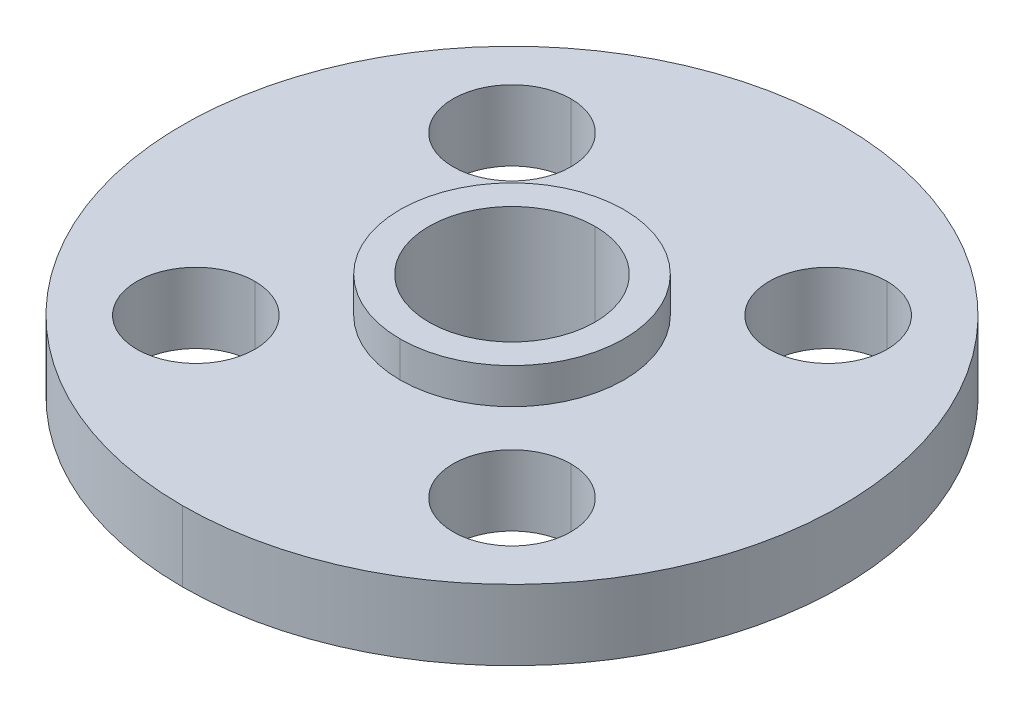
ISO-10303-21;
HEADER;
FILE_DESCRIPTION(('STEP AP214'),'2;1');
FILE_NAME('part.step','',(''),(''),'','','');
FILE_SCHEMA(('AUTOMOTIVE_DESIGN { 1 0 10303 214 1 1 1 1 }'));
ENDSEC;
DATA;
#1=APPLICATION_CONTEXT('core data for automotive mechanical design processes');
#2=APPLICATION_PROTOCOL_DEFINITION('international standard','automotive_design',2000,#1);
#3=PRODUCT_CONTEXT('',#1,'mechanical');
#4=PRODUCT('Part','Part','',(#3));
#5=PRODUCT_RELATED_PRODUCT_CATEGORY('part','',(#4));
#6=PRODUCT_DEFINITION_FORMATION('','',#4);
#7=PRODUCT_DEFINITION_CONTEXT('part definition',#1,'design');
#8=PRODUCT_DEFINITION('design','',#6,#7);
#9=PRODUCT_DEFINITION_SHAPE('','',#8);
#10=(LENGTH_UNIT() NAMED_UNIT(*) SI_UNIT(.MILLI.,.METRE.));
#11=(NAMED_UNIT(*) PLANE_ANGLE_UNIT() SI_UNIT($,.RADIAN.));
#12=(NAMED_UNIT(*) SI_UNIT($,.STERADIAN.) SOLID_ANGLE_UNIT());
#13=UNCERTAINTY_MEASURE_WITH_UNIT(LENGTH_MEASURE(1.E-05),#10,'distance_accuracy_value','');
#14=(GEOMETRIC_REPRESENTATION_CONTEXT(3) GLOBAL_UNCERTAINTY_ASSIGNED_CONTEXT((#13)) GLOBAL_UNIT_ASSIGNED_CONTEXT((#10,
#11,#12)) REPRESENTATION_CONTEXT('',''));
#15=CARTESIAN_POINT('',(0.,0.,0.));
#16=DIRECTION('',(0.,0.,1.));
#17=DIRECTION('',(1.,0.,0.));
#18=AXIS2_PLACEMENT_3D('',#15,#16,#17);
#19=CARTESIAN_POINT('',(-21.3192694527746,-7.95,-21.3192694527743));
#20=DIRECTION('',(0.,1.,0.));
#21=DIRECTION('',(0.,0.,1.));
#22=AXIS2_PLACEMENT_3D('',#19,#20,#21);
#23=CYLINDRICAL_SURFACE('',#22,7.95);
#24=DIRECTION('',(0.,1.,0.));
#25=VECTOR('',#24,1.);
#26=CARTESIAN_POINT('',(-21.3192694527746,-7.95,-29.2692694527743));
#27=LINE('',#26,#25);
#28=CARTESIAN_POINT('',(-21.3192694527746,-6.35,-29.2692694527743));
#29=VERTEX_POINT('',#28);
#30=CARTESIAN_POINT('',(-21.3192694527746,3.15,-29.2692694527743));
#31=VERTEX_POINT('',#30);
#32=EDGE_CURVE('E242',#29,#31,#27,.T.);
#33=ORIENTED_EDGE('',*,*,#32,.F.);
#34=CARTESIAN_POINT('',(-21.3192694527746,-6.35,-21.3192694527743));
#35=DIRECTION('',(0.,1.,0.));
#36=DIRECTION('',(0.,0.,1.));
#37=AXIS2_PLACEMENT_3D('',#34,#35,#36);
#38=CIRCLE('',#37,7.95);
#39=CARTESIAN_POINT('',(-21.3192694527746,-6.35,-13.3692694527743));
#40=VERTEX_POINT('',#39);
#41=EDGE_CURVE('E233',#40,#29,#38,.T.);
#42=ORIENTED_EDGE('',*,*,#41,.F.);
#43=DIRECTION('',(0.,1.,0.));
#44=VECTOR('',#43,1.);
#45=CARTESIAN_POINT('',(-21.3192694527746,-7.95,-13.3692694527743));
#46=LINE('',#45,#44);
#47=CARTESIAN_POINT('',(-21.3192694527746,3.15,-13.3692694527743));
#48=VERTEX_POINT('',#47);
#49=EDGE_CURVE('E216',#40,#48,#46,.T.);
#50=ORIENTED_EDGE('',*,*,#49,.T.);
#51=CARTESIAN_POINT('',(-21.3192694527746,3.15,-21.3192694527743));
#52=DIRECTION('',(0.,1.,0.));
#53=DIRECTION('',(1.,0.,0.));
#54=AXIS2_PLACEMENT_3D('',#51,#52,#53);
#55=CIRCLE('',#54,7.95);
#56=EDGE_CURVE('E262',#48,#31,#55,.T.);
#57=ORIENTED_EDGE('',*,*,#56,.T.);
#58=EDGE_LOOP('',(#33,#42,#50,#57));
#59=FACE_BOUND('',#58,.T.);
#60=ADVANCED_FACE('F17',(#59),#23,.F.);
#61=CARTESIAN_POINT('',(-21.3192694527743,-7.95,21.3192694527745));
#62=DIRECTION('',(0.,1.,0.));
#63=DIRECTION('',(0.,0.,1.));
#64=AXIS2_PLACEMENT_3D('',#61,#62,#63);
#65=CYLINDRICAL_SURFACE('',#64,7.95);
#66=DIRECTION('',(0.,1.,0.));
#67=VECTOR('',#66,1.);
#68=CARTESIAN_POINT('',(-21.3192694527743,-7.95,13.3692694527745));
#69=LINE('',#68,#67);
#70=CARTESIAN_POINT('',(-21.3192694527743,-6.35,13.3692694527745));
#71=VERTEX_POINT('',#70);
#72=CARTESIAN_POINT('',(-21.3192694527743,3.15,13.3692694527745));
#73=VERTEX_POINT('',#72);
#74=EDGE_CURVE('E252',#71,#73,#69,.T.);
#75=ORIENTED_EDGE('',*,*,#74,.F.);
#76=CARTESIAN_POINT('',(-21.3192694527743,-6.35,21.3192694527745));
#77=DIRECTION('',(0.,1.,0.));
#78=DIRECTION('',(0.,0.,1.));
#79=AXIS2_PLACEMENT_3D('',#76,#77,#78);
#80=CIRCLE('',#79,7.95);
#81=CARTESIAN_POINT('',(-21.3192694527743,-6.35,29.2692694527745));
#82=VERTEX_POINT('',#81);
#83=EDGE_CURVE('E237',#82,#71,#80,.T.);
#84=ORIENTED_EDGE('',*,*,#83,.F.);
#85=DIRECTION('',(0.,1.,0.));
#86=VECTOR('',#85,1.);
#87=CARTESIAN_POINT('',(-21.3192694527743,-7.95,29.2692694527745));
#88=LINE('',#87,#86);
#89=CARTESIAN_POINT('',(-21.3192694527743,3.15,29.2692694527745));
#90=VERTEX_POINT('',#89);
#91=EDGE_CURVE('E251',#82,#90,#88,.T.);
#92=ORIENTED_EDGE('',*,*,#91,.T.);
#93=CARTESIAN_POINT('',(-21.3192694527743,3.15,21.3192694527745));
#94=DIRECTION('',(0.,1.,0.));
#95=DIRECTION('',(0.,0.,-1.));
#96=AXIS2_PLACEMENT_3D('',#93,#94,#95);
#97=CIRCLE('',#96,7.95);
#98=EDGE_CURVE('E330',#90,#73,#97,.T.);
#99=ORIENTED_EDGE('',*,*,#98,.T.);
#100=EDGE_LOOP('',(#75,#84,#92,#99));
#101=FACE_BOUND('',#100,.T.);
#102=ADVANCED_FACE('F392',(#101),#65,.F.);
#103=CARTESIAN_POINT('',(21.3192694527747,-7.95,21.3192694527742));
#104=DIRECTION('',(0.,1.,0.));
#105=DIRECTION('',(0.,0.,1.));
#106=AXIS2_PLACEMENT_3D('',#103,#104,#105);
#107=CYLINDRICAL_SURFACE('',#106,7.95);
#108=DIRECTION('',(0.,1.,0.));
#109=VECTOR('',#108,1.);
#110=CARTESIAN_POINT('',(21.3192694527747,-7.95,13.3692694527741));
#111=LINE('',#110,#109);
#112=CARTESIAN_POINT('',(21.3192694527747,-6.35,13.3692694527741));
#113=VERTEX_POINT('',#112);
#114=CARTESIAN_POINT('',(21.3192694527747,3.15,13.3692694527741));
#115=VERTEX_POINT('',#114);
#116=EDGE_CURVE('E222',#113,#115,#111,.T.);
#117=ORIENTED_EDGE('',*,*,#116,.F.);
#118=CARTESIAN_POINT('',(21.3192694527747,-6.35,21.3192694527742));
#119=DIRECTION('',(0.,1.,0.));
#120=DIRECTION('',(0.,0.,1.));
#121=AXIS2_PLACEMENT_3D('',#118,#119,#120);
#122=CIRCLE('',#121,7.95);
#123=CARTESIAN_POINT('',(21.3192694527747,-6.35,29.2692694527742));
#124=VERTEX_POINT('',#123);
#125=EDGE_CURVE('E310',#124,#113,#122,.T.);
#126=ORIENTED_EDGE('',*,*,#125,.F.);
#127=DIRECTION('',(0.,1.,0.));
#128=VECTOR('',#127,1.);
#129=CARTESIAN_POINT('',(21.3192694527747,-7.95,29.2692694527742));
#130=LINE('',#129,#128);
#131=CARTESIAN_POINT('',(21.3192694527747,3.15,29.2692694527742));
#132=VERTEX_POINT('',#131);
#133=EDGE_CURVE('E208',#124,#132,#130,.T.);
#134=ORIENTED_EDGE('',*,*,#133,.T.);
#135=CARTESIAN_POINT('',(21.3192694527747,3.15,21.3192694527742));
#136=DIRECTION('',(0.,1.,0.));
#137=DIRECTION('',(-1.,0.,0.));
#138=AXIS2_PLACEMENT_3D('',#135,#136,#137);
#139=CIRCLE('',#138,7.95);
#140=EDGE_CURVE('E191',#132,#115,#139,.T.);
#141=ORIENTED_EDGE('',*,*,#140,.T.);
#142=EDGE_LOOP('',(#117,#126,#134,#141));
#143=FACE_BOUND('',#142,.T.);
#144=ADVANCED_FACE('F427',(#143),#107,.F.);
#145=CARTESIAN_POINT('',(21.3192694527743,-7.95,-21.3192694527745));
#146=DIRECTION('',(0.,1.,0.));
#147=DIRECTION('',(0.,0.,1.));
#148=AXIS2_PLACEMENT_3D('',#145,#146,#147);
#149=CYLINDRICAL_SURFACE('',#148,7.95);
#150=DIRECTION('',(0.,1.,0.));
#151=VECTOR('',#150,1.);
#152=CARTESIAN_POINT('',(21.3192694527743,-7.95,-29.2692694527745));
#153=LINE('',#152,#151);
#154=CARTESIAN_POINT('',(21.3192694527743,-6.35,-29.2692694527745));
#155=VERTEX_POINT('',#154);
#156=CARTESIAN_POINT('',(21.3192694527743,3.15,-29.2692694527745));
#157=VERTEX_POINT('',#156);
#158=EDGE_CURVE('E184',#155,#157,#153,.T.);
#159=ORIENTED_EDGE('',*,*,#158,.F.);
#160=CARTESIAN_POINT('',(21.3192694527743,-6.35,-21.3192694527745));
#161=DIRECTION('',(0.,1.,0.));
#162=DIRECTION('',(0.,0.,1.));
#163=AXIS2_PLACEMENT_3D('',#160,#161,#162);
#164=CIRCLE('',#163,7.95);
#165=CARTESIAN_POINT('',(21.3192694527743,-6.35,-13.3692694527745));
#166=VERTEX_POINT('',#165);
#167=EDGE_CURVE('E263',#166,#155,#164,.T.);
#168=ORIENTED_EDGE('',*,*,#167,.F.);
#169=DIRECTION('',(0.,1.,0.));
#170=VECTOR('',#169,1.);
#171=CARTESIAN_POINT('',(21.3192694527743,-7.95,-13.3692694527745));
#172=LINE('',#171,#170);
#173=CARTESIAN_POINT('',(21.3192694527743,3.15,-13.3692694527745));
#174=VERTEX_POINT('',#173);
#175=EDGE_CURVE('E187',#166,#174,#172,.T.);
#176=ORIENTED_EDGE('',*,*,#175,.T.);
#177=CARTESIAN_POINT('',(21.3192694527743,3.15,-21.3192694527745));
#178=DIRECTION('',(0.,1.,0.));
#179=DIRECTION('',(0.,0.,1.));
#180=AXIS2_PLACEMENT_3D('',#177,#178,#179);
#181=CIRCLE('',#180,7.95);
#182=EDGE_CURVE('E180',#174,#157,#181,.T.);
#183=ORIENTED_EDGE('',*,*,#182,.T.);
#184=EDGE_LOOP('',(#159,#168,#176,#183));
#185=FACE_BOUND('',#184,.T.);
#186=ADVANCED_FACE('F182',(#185),#149,.F.);
#187=CARTESIAN_POINT('',(11.2,7.95,0.));
#188=DIRECTION('',(0.,-1.,0.));
#189=DIRECTION('',(0.,0.,-1.));
#190=AXIS2_PLACEMENT_3D('',#187,#188,#189);
#191=PLANE('',#190);
#192=CARTESIAN_POINT('',(0.,7.95,0.));
#193=DIRECTION('',(0.,1.,0.));
#194=DIRECTION('',(0.,0.,1.));
#195=AXIS2_PLACEMENT_3D('',#192,#193,#194);
#196=CIRCLE('',#195,11.2);
#197=CARTESIAN_POINT('',(0.,7.95,11.2));
#198=VERTEX_POINT('',#197);
#199=CARTESIAN_POINT('',(0.,7.95,-11.2));
#200=VERTEX_POINT('',#199);
#201=EDGE_CURVE('E41',#198,#200,#196,.T.);
#202=ORIENTED_EDGE('',*,*,#201,.F.);
#203=CARTESIAN_POINT('',(0.,7.95,0.));
#204=DIRECTION('',(0.,1.,0.));
#205=DIRECTION('',(0.,0.,1.));
#206=AXIS2_PLACEMENT_3D('',#203,#204,#205);
#207=CIRCLE('',#206,11.2);
#208=EDGE_CURVE('E329',#200,#198,#207,.T.);
#209=ORIENTED_EDGE('',*,*,#208,.F.);
#210=EDGE_LOOP('',(#202,#209));
#211=FACE_BOUND('',#210,.T.);
#212=CARTESIAN_POINT('',(0.,7.95,0.));
#213=DIRECTION('',(0.,1.,0.));
#214=DIRECTION('',(0.,0.,1.));
#215=AXIS2_PLACEMENT_3D('',#212,#213,#214);
#216=CIRCLE('',#215,15.1);
#217=CARTESIAN_POINT('',(0.,7.95,15.1));
#218=VERTEX_POINT('',#217);
#219=CARTESIAN_POINT('',(0.,7.95,-15.1));
#220=VERTEX_POINT('',#219);
#221=EDGE_CURVE('E295',#218,#220,#216,.T.);
#222=ORIENTED_EDGE('',*,*,#221,.T.);
#223=CARTESIAN_POINT('',(0.,7.95,0.));
#224=DIRECTION('',(0.,1.,0.));
#225=DIRECTION('',(0.,0.,1.));
#226=AXIS2_PLACEMENT_3D('',#223,#224,#225);
#227=CIRCLE('',#226,15.1);
#228=EDGE_CURVE('E11',#220,#218,#227,.T.);
#229=ORIENTED_EDGE('',*,*,#228,.T.);
#230=EDGE_LOOP('',(#222,#229));
#231=FACE_BOUND('',#230,.T.);
#232=ADVANCED_FACE('F517',(#211,#231),#191,.F.);
#233=CARTESIAN_POINT('',(0.,0.,0.));
#234=DIRECTION('',(0.,1.,0.));
#235=DIRECTION('',(0.,0.,1.));
#236=AXIS2_PLACEMENT_3D('',#233,#234,#235);
#237=CYLINDRICAL_SURFACE('',#236,15.1);
#238=DIRECTION('',(0.,1.,0.));
#239=VECTOR('',#238,1.);
#240=CARTESIAN_POINT('',(0.,0.,-15.1));
#241=LINE('',#240,#239);
#242=CARTESIAN_POINT('',(0.,3.15,-15.1));
#243=VERTEX_POINT('',#242);
#244=EDGE_CURVE('E285',#243,#220,#241,.T.);
#245=ORIENTED_EDGE('',*,*,#244,.F.);
#246=CARTESIAN_POINT('',(0.,3.15,0.));
#247=DIRECTION('',(0.,1.,0.));
#248=DIRECTION('',(0.,0.,1.));
#249=AXIS2_PLACEMENT_3D('',#246,#247,#248);
#250=CIRCLE('',#249,15.1);
#251=CARTESIAN_POINT('',(0.,3.15,15.1));
#252=VERTEX_POINT('',#251);
#253=EDGE_CURVE('E28',#243,#252,#250,.T.);
#254=ORIENTED_EDGE('',*,*,#253,.T.);
#255=DIRECTION('',(0.,1.,0.));
#256=VECTOR('',#255,1.);
#257=CARTESIAN_POINT('',(0.,0.,15.1));
#258=LINE('',#257,#256);
#259=EDGE_CURVE('E337',#252,#218,#258,.T.);
#260=ORIENTED_EDGE('',*,*,#259,.T.);
#261=ORIENTED_EDGE('',*,*,#228,.F.);
#262=EDGE_LOOP('',(#245,#254,#260,#261));
#263=FACE_BOUND('',#262,.T.);
#264=ADVANCED_FACE('F397',(#263),#237,.T.);
#265=CARTESIAN_POINT('',(15.1,3.15,0.));
#266=DIRECTION('',(0.,-1.,0.));
#267=DIRECTION('',(0.,0.,-1.));
#268=AXIS2_PLACEMENT_3D('',#265,#266,#267);
#269=PLANE('',#268);
#270=CARTESIAN_POINT('',(0.,3.15,0.));
#271=DIRECTION('',(0.,1.,0.));
#272=DIRECTION('',(0.,0.,1.));
#273=AXIS2_PLACEMENT_3D('',#270,#271,#272);
#274=CIRCLE('',#273,15.1);
#275=EDGE_CURVE('E279',#252,#243,#274,.T.);
#276=ORIENTED_EDGE('',*,*,#275,.F.);
#277=ORIENTED_EDGE('',*,*,#253,.F.);
#278=EDGE_LOOP('',(#276,#277));
#279=FACE_BOUND('',#278,.T.);
#280=ORIENTED_EDGE('',*,*,#182,.F.);
#281=CARTESIAN_POINT('',(21.3192694527743,3.15,-21.3192694527745));
#282=DIRECTION('',(0.,1.,0.));
#283=DIRECTION('',(0.,0.,1.));
#284=AXIS2_PLACEMENT_3D('',#281,#282,#283);
#285=CIRCLE('',#284,7.95);
#286=EDGE_CURVE('E193',#157,#174,#285,.T.);
#287=ORIENTED_EDGE('',*,*,#286,.F.);
#288=EDGE_LOOP('',(#280,#287));
#289=FACE_BOUND('',#288,.T.);
#290=ORIENTED_EDGE('',*,*,#140,.F.);
#291=CARTESIAN_POINT('',(21.3192694527747,3.15,21.3192694527742));
#292=DIRECTION('',(0.,1.,0.));
#293=DIRECTION('',(-1.,0.,0.));
#294=AXIS2_PLACEMENT_3D('',#291,#292,#293);
#295=CIRCLE('',#294,7.95);
#296=EDGE_CURVE('E226',#115,#132,#295,.T.);
#297=ORIENTED_EDGE('',*,*,#296,.F.);
#298=EDGE_LOOP('',(#290,#297));
#299=FACE_BOUND('',#298,.T.);
#300=ORIENTED_EDGE('',*,*,#98,.F.);
#301=CARTESIAN_POINT('',(-21.3192694527743,3.15,21.3192694527745));
#302=DIRECTION('',(0.,1.,0.));
#303=DIRECTION('',(0.,0.,-1.));
#304=AXIS2_PLACEMENT_3D('',#301,#302,#303);
#305=CIRCLE('',#304,7.95);
#306=EDGE_CURVE('E247',#73,#90,#305,.T.);
#307=ORIENTED_EDGE('',*,*,#306,.F.);
#308=EDGE_LOOP('',(#300,#307));
#309=FACE_BOUND('',#308,.T.);
#310=ORIENTED_EDGE('',*,*,#56,.F.);
#311=CARTESIAN_POINT('',(-21.3192694527746,3.15,-21.3192694527743));
#312=DIRECTION('',(0.,1.,0.));
#313=DIRECTION('',(1.,0.,0.));
#314=AXIS2_PLACEMENT_3D('',#311,#312,#313);
#315=CIRCLE('',#314,7.95);
#316=EDGE_CURVE('E221',#31,#48,#315,.T.);
#317=ORIENTED_EDGE('',*,*,#316,.F.);
#318=EDGE_LOOP('',(#310,#317));
#319=FACE_BOUND('',#318,.T.);
#320=CARTESIAN_POINT('',(0.,3.15,0.));
#321=DIRECTION('',(0.,1.,0.));
#322=DIRECTION('',(0.,0.,1.));
#323=AXIS2_PLACEMENT_3D('',#320,#321,#322);
#324=CIRCLE('',#323,44.45);
#325=CARTESIAN_POINT('',(0.,3.15,44.45));
#326=VERTEX_POINT('',#325);
#327=CARTESIAN_POINT('',(0.,3.15,-44.45));
#328=VERTEX_POINT('',#327);
#329=EDGE_CURVE('E231',#326,#328,#324,.T.);
#330=ORIENTED_EDGE('',*,*,#329,.T.);
#331=CARTESIAN_POINT('',(0.,3.15,0.));
#332=DIRECTION('',(0.,1.,0.));
#333=DIRECTION('',(0.,0.,1.));
#334=AXIS2_PLACEMENT_3D('',#331,#332,#333);
#335=CIRCLE('',#334,44.45);
#336=EDGE_CURVE('E258',#328,#326,#335,.T.);
#337=ORIENTED_EDGE('',*,*,#336,.T.);
#338=EDGE_LOOP('',(#330,#337));
#339=FACE_BOUND('',#338,.T.);
#340=ADVANCED_FACE('F194',(#279,#289,#299,#309,#319,#339),#269,.F.);
#341=CARTESIAN_POINT('',(0.,0.,0.));
#342=DIRECTION('',(0.,1.,0.));
#343=DIRECTION('',(0.,0.,1.));
#344=AXIS2_PLACEMENT_3D('',#341,#342,#343);
#345=CYLINDRICAL_SURFACE('',#344,44.45);
#346=DIRECTION('',(0.,1.,0.));
#347=VECTOR('',#346,1.);
#348=CARTESIAN_POINT('',(0.,0.,-44.45));
#349=LINE('',#348,#347);
#350=CARTESIAN_POINT('',(0.,-6.35,-44.45));
#351=VERTEX_POINT('',#350);
#352=EDGE_CURVE('E227',#351,#328,#349,.T.);
#353=ORIENTED_EDGE('',*,*,#352,.F.);
#354=CARTESIAN_POINT('',(0.,-6.35,0.));
#355=DIRECTION('',(0.,1.,0.));
#356=DIRECTION('',(0.,0.,1.));
#357=AXIS2_PLACEMENT_3D('',#354,#355,#356);
#358=CIRCLE('',#357,44.45);
#359=CARTESIAN_POINT('',(0.,-6.35,44.45));
#360=VERTEX_POINT('',#359);
#361=EDGE_CURVE('E238',#351,#360,#358,.T.);
#362=ORIENTED_EDGE('',*,*,#361,.T.);
#363=DIRECTION('',(0.,1.,0.));
#364=VECTOR('',#363,1.);
#365=CARTESIAN_POINT('',(0.,0.,44.45));
#366=LINE('',#365,#364);
#367=EDGE_CURVE('E267',#360,#326,#366,.T.);
#368=ORIENTED_EDGE('',*,*,#367,.T.);
#369=ORIENTED_EDGE('',*,*,#336,.F.);
#370=EDGE_LOOP('',(#353,#362,#368,#369));
#371=FACE_BOUND('',#370,.T.);
#372=ADVANCED_FACE('F396',(#371),#345,.T.);
#373=CARTESIAN_POINT('',(17.45,-6.35,0.));
#374=DIRECTION('',(0.,1.,0.));
#375=DIRECTION('',(1.,0.,0.));
#376=AXIS2_PLACEMENT_3D('',#373,#374,#375);
#377=PLANE('',#376);
#378=CARTESIAN_POINT('',(0.,-6.35,0.));
#379=DIRECTION('',(0.,1.,0.));
#380=DIRECTION('',(0.,0.,1.));
#381=AXIS2_PLACEMENT_3D('',#378,#379,#380);
#382=CIRCLE('',#381,17.45);
#383=CARTESIAN_POINT('',(0.,-6.35,17.45));
#384=VERTEX_POINT('',#383);
#385=CARTESIAN_POINT('',(0.,-6.35,-17.45));
#386=VERTEX_POINT('',#385);
#387=EDGE_CURVE('E215',#384,#386,#382,.T.);
#388=ORIENTED_EDGE('',*,*,#387,.T.);
#389=CARTESIAN_POINT('',(0.,-6.35,0.));
#390=DIRECTION('',(0.,1.,0.));
#391=DIRECTION('',(0.,0.,1.));
#392=AXIS2_PLACEMENT_3D('',#389,#390,#391);
#393=CIRCLE('',#392,17.45);
#394=EDGE_CURVE('E103',#386,#384,#393,.T.);
#395=ORIENTED_EDGE('',*,*,#394,.T.);
#396=EDGE_LOOP('',(#388,#395));
#397=FACE_BOUND('',#396,.T.);
#398=ORIENTED_EDGE('',*,*,#167,.T.);
#399=CARTESIAN_POINT('',(21.3192694527743,-6.35,-21.3192694527745));
#400=DIRECTION('',(0.,1.,0.));
#401=DIRECTION('',(0.,0.,1.));
#402=AXIS2_PLACEMENT_3D('',#399,#400,#401);
#403=CIRCLE('',#402,7.95);
#404=EDGE_CURVE('E201',#155,#166,#403,.T.);
#405=ORIENTED_EDGE('',*,*,#404,.T.);
#406=EDGE_LOOP('',(#398,#405));
#407=FACE_BOUND('',#406,.T.);
#408=ORIENTED_EDGE('',*,*,#125,.T.);
#409=CARTESIAN_POINT('',(21.3192694527747,-6.35,21.3192694527742));
#410=DIRECTION('',(0.,1.,0.));
#411=DIRECTION('',(0.,0.,1.));
#412=AXIS2_PLACEMENT_3D('',#409,#410,#411);
#413=CIRCLE('',#412,7.95);
#414=EDGE_CURVE('E21',#113,#124,#413,.T.);
#415=ORIENTED_EDGE('',*,*,#414,.T.);
#416=EDGE_LOOP('',(#408,#415));
#417=FACE_BOUND('',#416,.T.);
#418=ORIENTED_EDGE('',*,*,#83,.T.);
#419=CARTESIAN_POINT('',(-21.3192694527743,-6.35,21.3192694527745));
#420=DIRECTION('',(0.,1.,0.));
#421=DIRECTION('',(0.,0.,1.));
#422=AXIS2_PLACEMENT_3D('',#419,#420,#421);
#423=CIRCLE('',#422,7.95);
#424=EDGE_CURVE('E220',#71,#82,#423,.T.);
#425=ORIENTED_EDGE('',*,*,#424,.T.);
#426=EDGE_LOOP('',(#418,#425));
#427=FACE_BOUND('',#426,.T.);
#428=ORIENTED_EDGE('',*,*,#41,.T.);
#429=CARTESIAN_POINT('',(-21.3192694527746,-6.35,-21.3192694527743));
#430=DIRECTION('',(0.,1.,0.));
#431=DIRECTION('',(0.,0.,1.));
#432=AXIS2_PLACEMENT_3D('',#429,#430,#431);
#433=CIRCLE('',#432,7.95);
#434=EDGE_CURVE('E246',#29,#40,#433,.T.);
#435=ORIENTED_EDGE('',*,*,#434,.T.);
#436=EDGE_LOOP('',(#428,#435));
#437=FACE_BOUND('',#436,.T.);
#438=CARTESIAN_POINT('',(0.,-6.35,0.));
#439=DIRECTION('',(0.,1.,0.));
#440=DIRECTION('',(0.,0.,1.));
#441=AXIS2_PLACEMENT_3D('',#438,#439,#440);
#442=CIRCLE('',#441,44.45);
#443=EDGE_CURVE('E232',#360,#351,#442,.T.);
#444=ORIENTED_EDGE('',*,*,#443,.F.);
#445=ORIENTED_EDGE('',*,*,#361,.F.);
#446=EDGE_LOOP('',(#444,#445));
#447=FACE_BOUND('',#446,.T.);
#448=ADVANCED_FACE('F366',(#397,#407,#417,#427,#437,#447),#377,.F.);
#449=CARTESIAN_POINT('',(0.,0.,0.));
#450=DIRECTION('',(0.,1.,0.));
#451=DIRECTION('',(0.,0.,1.));
#452=AXIS2_PLACEMENT_3D('',#449,#450,#451);
#453=CYLINDRICAL_SURFACE('',#452,17.45);
#454=DIRECTION('',(0.,1.,0.));
#455=VECTOR('',#454,1.);
#456=CARTESIAN_POINT('',(0.,0.,-17.45));
#457=LINE('',#456,#455);
#458=CARTESIAN_POINT('',(0.,-7.95,-17.45));
#459=VERTEX_POINT('',#458);
#460=EDGE_CURVE('E275',#459,#386,#457,.T.);
#461=ORIENTED_EDGE('',*,*,#460,.F.);
#462=CARTESIAN_POINT('',(0.,-7.95,0.));
#463=DIRECTION('',(0.,1.,0.));
#464=DIRECTION('',(0.,0.,1.));
#465=AXIS2_PLACEMENT_3D('',#462,#463,#464);
#466=CIRCLE('',#465,17.45);
#467=CARTESIAN_POINT('',(0.,-7.95,17.45));
#468=VERTEX_POINT('',#467);
#469=EDGE_CURVE('E361',#459,#468,#466,.T.);
#470=ORIENTED_EDGE('',*,*,#469,.T.);
#471=DIRECTION('',(0.,1.,0.));
#472=VECTOR('',#471,1.);
#473=CARTESIAN_POINT('',(0.,0.,17.45));
#474=LINE('',#473,#472);
#475=EDGE_CURVE('E212',#468,#384,#474,.T.);
#476=ORIENTED_EDGE('',*,*,#475,.T.);
#477=ORIENTED_EDGE('',*,*,#394,.F.);
#478=EDGE_LOOP('',(#461,#470,#476,#477));
#479=FACE_BOUND('',#478,.T.);
#480=ADVANCED_FACE('F365',(#479),#453,.T.);
#481=CARTESIAN_POINT('',(11.2,-7.95,0.));
#482=DIRECTION('',(0.,1.,0.));
#483=DIRECTION('',(1.,0.,0.));
#484=AXIS2_PLACEMENT_3D('',#481,#482,#483);
#485=PLANE('',#484);
#486=CARTESIAN_POINT('',(0.,-7.95,0.));
#487=DIRECTION('',(0.,1.,0.));
#488=DIRECTION('',(0.,0.,1.));
#489=AXIS2_PLACEMENT_3D('',#486,#487,#488);
#490=CIRCLE('',#489,11.2);
#491=CARTESIAN_POINT('',(0.,-7.95,11.2));
#492=VERTEX_POINT('',#491);
#493=CARTESIAN_POINT('',(0.,-7.95,-11.2));
#494=VERTEX_POINT('',#493);
#495=EDGE_CURVE('E91',#492,#494,#490,.T.);
#496=ORIENTED_EDGE('',*,*,#495,.T.);
#497=CARTESIAN_POINT('',(0.,-7.95,0.));
#498=DIRECTION('',(0.,1.,0.));
#499=DIRECTION('',(0.,0.,1.));
#500=AXIS2_PLACEMENT_3D('',#497,#498,#499);
#501=CIRCLE('',#500,11.2);
#502=EDGE_CURVE('E214',#494,#492,#501,.T.);
#503=ORIENTED_EDGE('',*,*,#502,.T.);
#504=EDGE_LOOP('',(#496,#503));
#505=FACE_BOUND('',#504,.T.);
#506=CARTESIAN_POINT('',(0.,-7.95,0.));
#507=DIRECTION('',(0.,1.,0.));
#508=DIRECTION('',(0.,0.,1.));
#509=AXIS2_PLACEMENT_3D('',#506,#507,#508);
#510=CIRCLE('',#509,17.45);
#511=EDGE_CURVE('E271',#468,#459,#510,.T.);
#512=ORIENTED_EDGE('',*,*,#511,.F.);
#513=ORIENTED_EDGE('',*,*,#469,.F.);
#514=EDGE_LOOP('',(#512,#513));
#515=FACE_BOUND('',#514,.T.);
#516=ADVANCED_FACE('F360',(#505,#515),#485,.F.);
#517=CARTESIAN_POINT('',(0.,0.,0.));
#518=DIRECTION('',(0.,1.,0.));
#519=DIRECTION('',(0.,0.,1.));
#520=AXIS2_PLACEMENT_3D('',#517,#518,#519);
#521=CYLINDRICAL_SURFACE('',#520,11.2);
#522=DIRECTION('',(0.,1.,0.));
#523=VECTOR('',#522,1.);
#524=CARTESIAN_POINT('',(0.,0.,-11.2));
#525=LINE('',#524,#523);
#526=EDGE_CURVE('E241',#494,#200,#525,.T.);
#527=ORIENTED_EDGE('',*,*,#526,.F.);
#528=ORIENTED_EDGE('',*,*,#495,.F.);
#529=DIRECTION('',(0.,1.,0.));
#530=VECTOR('',#529,1.);
#531=CARTESIAN_POINT('',(0.,0.,11.2));
#532=LINE('',#531,#530);
#533=EDGE_CURVE('E255',#492,#198,#532,.T.);
#534=ORIENTED_EDGE('',*,*,#533,.T.);
#535=ORIENTED_EDGE('',*,*,#201,.T.);
#536=EDGE_LOOP('',(#527,#528,#534,#535));
#537=FACE_BOUND('',#536,.T.);
#538=ADVANCED_FACE('F433',(#537),#521,.F.);
#539=CARTESIAN_POINT('',(0.,0.,0.));
#540=DIRECTION('',(0.,1.,0.));
#541=DIRECTION('',(0.,0.,1.));
#542=AXIS2_PLACEMENT_3D('',#539,#540,#541);
#543=CYLINDRICAL_SURFACE('',#542,11.2);
#544=ORIENTED_EDGE('',*,*,#502,.F.);
#545=ORIENTED_EDGE('',*,*,#526,.T.);
#546=ORIENTED_EDGE('',*,*,#208,.T.);
#547=ORIENTED_EDGE('',*,*,#533,.F.);
#548=EDGE_LOOP('',(#544,#545,#546,#547));
#549=FACE_BOUND('',#548,.T.);
#550=ADVANCED_FACE('F436',(#549),#543,.F.);
#551=CARTESIAN_POINT('',(0.,0.,0.));
#552=DIRECTION('',(0.,1.,0.));
#553=DIRECTION('',(0.,0.,1.));
#554=AXIS2_PLACEMENT_3D('',#551,#552,#553);
#555=CYLINDRICAL_SURFACE('',#554,17.45);
#556=ORIENTED_EDGE('',*,*,#511,.T.);
#557=ORIENTED_EDGE('',*,*,#460,.T.);
#558=ORIENTED_EDGE('',*,*,#387,.F.);
#559=ORIENTED_EDGE('',*,*,#475,.F.);
#560=EDGE_LOOP('',(#556,#557,#558,#559));
#561=FACE_BOUND('',#560,.T.);
#562=ADVANCED_FACE('F356',(#561),#555,.T.);
#563=CARTESIAN_POINT('',(0.,0.,0.));
#564=DIRECTION('',(0.,1.,0.));
#565=DIRECTION('',(0.,0.,1.));
#566=AXIS2_PLACEMENT_3D('',#563,#564,#565);
#567=CYLINDRICAL_SURFACE('',#566,44.45);
#568=ORIENTED_EDGE('',*,*,#443,.T.);
#569=ORIENTED_EDGE('',*,*,#352,.T.);
#570=ORIENTED_EDGE('',*,*,#329,.F.);
#571=ORIENTED_EDGE('',*,*,#367,.F.);
#572=EDGE_LOOP('',(#568,#569,#570,#571));
#573=FACE_BOUND('',#572,.T.);
#574=ADVANCED_FACE('F405',(#573),#567,.T.);
#575=CARTESIAN_POINT('',(0.,0.,0.));
#576=DIRECTION('',(0.,1.,0.));
#577=DIRECTION('',(0.,0.,1.));
#578=AXIS2_PLACEMENT_3D('',#575,#576,#577);
#579=CYLINDRICAL_SURFACE('',#578,15.1);
#580=ORIENTED_EDGE('',*,*,#275,.T.);
#581=ORIENTED_EDGE('',*,*,#244,.T.);
#582=ORIENTED_EDGE('',*,*,#221,.F.);
#583=ORIENTED_EDGE('',*,*,#259,.F.);
#584=EDGE_LOOP('',(#580,#581,#582,#583));
#585=FACE_BOUND('',#584,.T.);
#586=ADVANCED_FACE('F19',(#585),#579,.T.);
#587=CARTESIAN_POINT('',(21.3192694527743,-7.95,-21.3192694527745));
#588=DIRECTION('',(0.,1.,0.));
#589=DIRECTION('',(0.,0.,1.));
#590=AXIS2_PLACEMENT_3D('',#587,#588,#589);
#591=CYLINDRICAL_SURFACE('',#590,7.95);
#592=ORIENTED_EDGE('',*,*,#404,.F.);
#593=ORIENTED_EDGE('',*,*,#158,.T.);
#594=ORIENTED_EDGE('',*,*,#286,.T.);
#595=ORIENTED_EDGE('',*,*,#175,.F.);
#596=EDGE_LOOP('',(#592,#593,#594,#595));
#597=FACE_BOUND('',#596,.T.);
#598=ADVANCED_FACE('F199',(#597),#591,.F.);
#599=CARTESIAN_POINT('',(21.3192694527747,-7.95,21.3192694527742));
#600=DIRECTION('',(0.,1.,0.));
#601=DIRECTION('',(0.,0.,1.));
#602=AXIS2_PLACEMENT_3D('',#599,#600,#601);
#603=CYLINDRICAL_SURFACE('',#602,7.95);
#604=ORIENTED_EDGE('',*,*,#414,.F.);
#605=ORIENTED_EDGE('',*,*,#116,.T.);
#606=ORIENTED_EDGE('',*,*,#296,.T.);
#607=ORIENTED_EDGE('',*,*,#133,.F.);
#608=EDGE_LOOP('',(#604,#605,#606,#607));
#609=FACE_BOUND('',#608,.T.);
#610=ADVANCED_FACE('F443',(#609),#603,.F.);
#611=CARTESIAN_POINT('',(-21.3192694527743,-7.95,21.3192694527745));
#612=DIRECTION('',(0.,1.,0.));
#613=DIRECTION('',(0.,0.,1.));
#614=AXIS2_PLACEMENT_3D('',#611,#612,#613);
#615=CYLINDRICAL_SURFACE('',#614,7.95);
#616=ORIENTED_EDGE('',*,*,#424,.F.);
#617=ORIENTED_EDGE('',*,*,#74,.T.);
#618=ORIENTED_EDGE('',*,*,#306,.T.);
#619=ORIENTED_EDGE('',*,*,#91,.F.);
#620=EDGE_LOOP('',(#616,#617,#618,#619));
#621=FACE_BOUND('',#620,.T.);
#622=ADVANCED_FACE('F389',(#621),#615,.F.);
#623=CARTESIAN_POINT('',(-21.3192694527746,-7.95,-21.3192694527743));
#624=DIRECTION('',(0.,1.,0.));
#625=DIRECTION('',(0.,0.,1.));
#626=AXIS2_PLACEMENT_3D('',#623,#624,#625);
#627=CYLINDRICAL_SURFACE('',#626,7.95);
#628=ORIENTED_EDGE('',*,*,#434,.F.);
#629=ORIENTED_EDGE('',*,*,#32,.T.);
#630=ORIENTED_EDGE('',*,*,#316,.T.);
#631=ORIENTED_EDGE('',*,*,#49,.F.);
#632=EDGE_LOOP('',(#628,#629,#630,#631));
#633=FACE_BOUND('',#632,.T.);
#634=ADVANCED_FACE('F442',(#633),#627,.F.);
#635=CLOSED_SHELL('',(#60,#102,#144,#186,#232,#264,#340,#372,#448,#480,#516,#538,#550,#562,#574,
#586,#598,#610,#622,#634));
#636=MANIFOLD_SOLID_BREP('B1',#635);
#637=ADVANCED_BREP_SHAPE_REPRESENTATION('',(#18,#636),#14);
#638=SHAPE_DEFINITION_REPRESENTATION(#9,#637);
ENDSEC;
END-ISO-10303-21;
